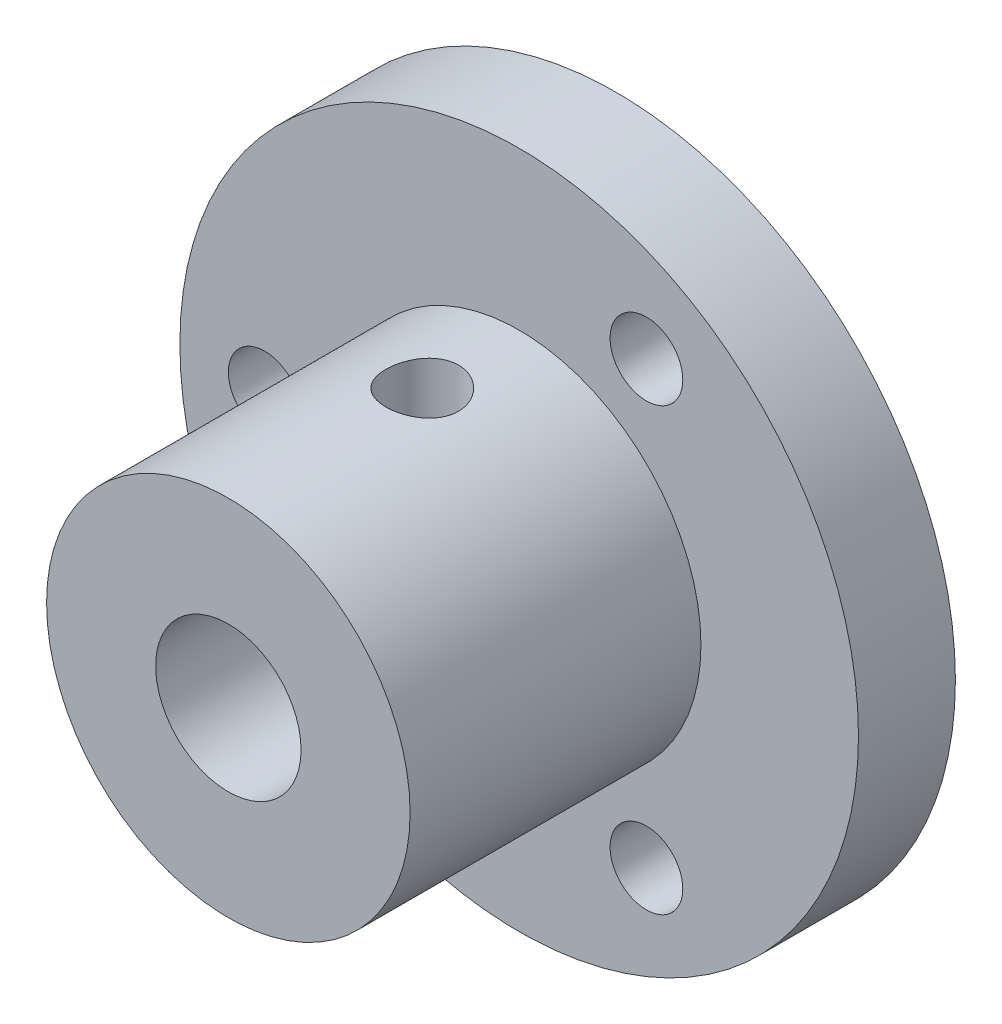
ISO-10303-21;
HEADER;
FILE_DESCRIPTION(('STEP AP214'),'2;1');
FILE_NAME('part.step','',(''),(''),'','','');
FILE_SCHEMA(('AUTOMOTIVE_DESIGN { 1 0 10303 214 1 1 1 1 }'));
ENDSEC;
DATA;
#1=APPLICATION_CONTEXT('core data for automotive mechanical design processes');
#2=APPLICATION_PROTOCOL_DEFINITION('international standard','automotive_design',2000,#1);
#3=PRODUCT_CONTEXT('',#1,'mechanical');
#4=PRODUCT('Part','Part','',(#3));
#5=PRODUCT_RELATED_PRODUCT_CATEGORY('part','',(#4));
#6=PRODUCT_DEFINITION_FORMATION('','',#4);
#7=PRODUCT_DEFINITION_CONTEXT('part definition',#1,'design');
#8=PRODUCT_DEFINITION('design','',#6,#7);
#9=PRODUCT_DEFINITION_SHAPE('','',#8);
#10=(LENGTH_UNIT() NAMED_UNIT(*) SI_UNIT(.MILLI.,.METRE.));
#11=(NAMED_UNIT(*) PLANE_ANGLE_UNIT() SI_UNIT($,.RADIAN.));
#12=(NAMED_UNIT(*) SI_UNIT($,.STERADIAN.) SOLID_ANGLE_UNIT());
#13=UNCERTAINTY_MEASURE_WITH_UNIT(LENGTH_MEASURE(1.E-05),#10,'distance_accuracy_value','');
#14=(GEOMETRIC_REPRESENTATION_CONTEXT(3) GLOBAL_UNCERTAINTY_ASSIGNED_CONTEXT((#13)) GLOBAL_UNIT_ASSIGNED_CONTEXT((#10,
#11,#12)) REPRESENTATION_CONTEXT('',''));
#15=CARTESIAN_POINT('',(0.,0.,0.));
#16=DIRECTION('',(0.,0.,1.));
#17=DIRECTION('',(1.,0.,0.));
#18=AXIS2_PLACEMENT_3D('',#15,#16,#17);
#19=CARTESIAN_POINT('',(0.,0.,4.));
#20=DIRECTION('',(0.,0.,-1.));
#21=DIRECTION('',(-1.,0.,0.));
#22=AXIS2_PLACEMENT_3D('',#19,#20,#21);
#23=CYLINDRICAL_SURFACE('',#22,3.);
#24=CARTESIAN_POINT('',(0.,-3.,6.5));
#25=CARTESIAN_POINT('',(0.0788579444268503,-2.99999570107562,6.50000495347579));
#26=CARTESIAN_POINT('',(0.157809899546344,-2.99685736529635,6.50625510968158));
#27=CARTESIAN_POINT('',(0.313380352903345,-2.98461234055736,6.53097932051231));
#28=CARTESIAN_POINT('',(0.389994130070445,-2.97549431743379,6.54947658949672));
#29=CARTESIAN_POINT('',(0.538400317320674,-2.95224419105063,6.59779071292494));
#30=CARTESIAN_POINT('',(0.61021020440872,-2.93813158766306,6.62756357637195));
#31=CARTESIAN_POINT('',(0.747708925209899,-2.90618664773642,6.69735593204748));
#32=CARTESIAN_POINT('',(0.81339824098509,-2.88835460450288,6.7373746163733));
#33=CARTESIAN_POINT('',(0.941261726642865,-2.84934387387093,6.82927587422793));
#34=CARTESIAN_POINT('',(1.00298281668316,-2.82802798691306,6.88172971885946));
#35=CARTESIAN_POINT('',(1.11716916730047,-2.78489955370114,6.99578221887056));
#36=CARTESIAN_POINT('',(1.16962737466015,-2.76308664313552,7.05738777765866));
#37=CARTESIAN_POINT('',(1.26787800067542,-2.71948426796021,7.19372502428507));
#38=CARTESIAN_POINT('',(1.31283800332746,-2.69782780455198,7.26910414751887));
#39=CARTESIAN_POINT('',(1.38925234033604,-2.65928968158481,7.42755100397932));
#40=CARTESIAN_POINT('',(1.4207163224495,-2.64240461410484,7.51061319308412));
#41=CARTESIAN_POINT('',(1.46719866328288,-2.61686800556713,7.67699765813289));
#42=CARTESIAN_POINT('',(1.48308878562066,-2.6077840737557,7.76000667810109));
#43=CARTESIAN_POINT('',(1.50064048996327,-2.59772834922792,7.92796825666922));
#44=CARTESIAN_POINT('',(1.50231613255961,-2.59674854014932,8.01291881130673));
#45=CARTESIAN_POINT('',(1.49203093075844,-2.60266395385873,8.17142903647305));
#46=CARTESIAN_POINT('',(1.48167683930523,-2.6086314549302,8.24513604683458));
#47=CARTESIAN_POINT('',(1.4504097735854,-2.62614343100775,8.38958286405956));
#48=CARTESIAN_POINT('',(1.42949343584648,-2.63768968247664,8.46032171795797));
#49=CARTESIAN_POINT('',(1.37731467057901,-2.66531214619112,8.59884369884849));
#50=CARTESIAN_POINT('',(1.34582260067399,-2.68148760995998,8.66651959817868));
#51=CARTESIAN_POINT('',(1.27356253150201,-2.71655106422105,8.79595143888501));
#52=CARTESIAN_POINT('',(1.2327903657187,-2.73544027170286,8.85770470340013));
#53=CARTESIAN_POINT('',(1.13709908236918,-2.77669736854929,8.98178187911484));
#54=CARTESIAN_POINT('',(1.08104168755392,-2.79920265355119,9.04318531036424));
#55=CARTESIAN_POINT('',(0.959333368112062,-2.84321434950611,9.15610312788635));
#56=CARTESIAN_POINT('',(0.89367788486143,-2.86472027938201,9.20761278805082));
#57=CARTESIAN_POINT('',(0.750774758747775,-2.90552980924446,9.30152849154459));
#58=CARTESIAN_POINT('',(0.673130387399115,-2.92468476243011,9.34340070866861));
#59=CARTESIAN_POINT('',(0.510699323233197,-2.95736821681863,9.41314554356451));
#60=CARTESIAN_POINT('',(0.425918364397915,-2.9709011841533,9.44102927752275));
#61=CARTESIAN_POINT('',(0.259149737491054,-2.98986500612153,9.47971310557501));
#62=CARTESIAN_POINT('',(0.17751229582249,-2.99587407451965,9.49173685362017));
#63=CARTESIAN_POINT('',(0.0131693999240281,-3.00109520188655,9.50219709670173));
#64=CARTESIAN_POINT('',(-0.0695355298048624,-3.00031048081978,9.5006400284592));
#65=CARTESIAN_POINT('',(-0.22684945797898,-2.99236788380152,9.48468996737189));
#66=CARTESIAN_POINT('',(-0.301589112074895,-2.98570868532253,9.47130120090501));
#67=CARTESIAN_POINT('',(-0.447610338452911,-2.9673325697226,9.43364289215732));
#68=CARTESIAN_POINT('',(-0.51889152853663,-2.95561509501618,9.40937215031976));
#69=CARTESIAN_POINT('',(-0.65833291267436,-2.92776377120382,9.35000230035045));
#70=CARTESIAN_POINT('',(-0.726345595508706,-2.91151322654446,9.31461342482557));
#71=CARTESIAN_POINT('',(-0.855692042548908,-2.87615961476126,9.23433869653015));
#72=CARTESIAN_POINT('',(-0.917022944664888,-2.85705533350407,9.18944879810691));
#73=CARTESIAN_POINT('',(-1.03765153393382,-2.81562332004297,9.08635936200393));
#74=CARTESIAN_POINT('',(-1.09615811672854,-2.79316327265249,9.02728569733228));
#75=CARTESIAN_POINT('',(-1.20278448167828,-2.7489358741323,8.90011227308341));
#76=CARTESIAN_POINT('',(-1.25089707856781,-2.72716901100071,8.83200632172812));
#77=CARTESIAN_POINT('',(-1.33756187171853,-2.68576788309734,8.68453451874054));
#78=CARTESIAN_POINT('',(-1.37553824370037,-2.66628794383591,8.60478310085828));
#79=CARTESIAN_POINT('',(-1.43712423890206,-2.63361108441202,8.43873489863755));
#80=CARTESIAN_POINT('',(-1.46075237380053,-2.62040607332625,8.35244671029966));
#81=CARTESIAN_POINT('',(-1.49079253120031,-2.60342251538703,8.18463466567294));
#82=CARTESIAN_POINT('',(-1.49863949460818,-2.59886075197597,8.10344861984713));
#83=CARTESIAN_POINT('',(-1.5010337315643,-2.59748031962405,7.94082939925321));
#84=CARTESIAN_POINT('',(-1.49558676993486,-2.60065829439585,7.85939634689321));
#85=CARTESIAN_POINT('',(-1.47288918838996,-2.61356793076615,7.70677474769984));
#86=CARTESIAN_POINT('',(-1.45681247151455,-2.62264641723988,7.63534929478289));
#87=CARTESIAN_POINT('',(-1.41476303733662,-2.64556524281479,7.49628782086345));
#88=CARTESIAN_POINT('',(-1.38878713673988,-2.65940711354503,7.42865302686195));
#89=CARTESIAN_POINT('',(-1.32572361795085,-2.69142795546804,7.2940627235202));
#90=CARTESIAN_POINT('',(-1.28800670672355,-2.70983583593881,7.22745814725646));
#91=CARTESIAN_POINT('',(-1.20322645745609,-2.7485299745229,7.10108819572811));
#92=CARTESIAN_POINT('',(-1.15615825686234,-2.76881720693416,7.04132640421833));
#93=CARTESIAN_POINT('',(-1.04730498999206,-2.81193484737138,6.92278702646799));
#94=CARTESIAN_POINT('',(-0.984426634495893,-2.83477474959942,6.86501134647456));
#95=CARTESIAN_POINT('',(-0.849232209349797,-2.87816628389896,6.7606055248471));
#96=CARTESIAN_POINT('',(-0.776911084957797,-2.89871667939293,6.71398139079514));
#97=CARTESIAN_POINT('',(-0.62389739517442,-2.93547014349806,6.6331454559319));
#98=CARTESIAN_POINT('',(-0.543149255665097,-2.95164144740899,6.5990237461453));
#99=CARTESIAN_POINT('',(-0.376113151707131,-2.9775201194848,6.54528774836389));
#100=CARTESIAN_POINT('',(-0.289841699383651,-2.98724585044602,6.52563222979143));
#101=CARTESIAN_POINT('',(-0.168902919736344,-2.99543192870217,6.50915388337139));
#102=CARTESIAN_POINT('',(-0.135242819162348,-2.99714048010376,6.50572603870049));
#103=CARTESIAN_POINT('',(-0.0677275977076379,-2.99942545465223,6.50114800172887));
#104=CARTESIAN_POINT('',(-0.0338724714699429,-3.00000184655071,6.49999787229469));
#105=CARTESIAN_POINT('',(0.,-3.,6.5));
#106=B_SPLINE_CURVE_WITH_KNOTS('',3,(#24,#25,#26,#27,#28,#29,#30,#31,#32,#33,#34,#35,#36,#37,
#38,#39,#40,#41,#42,#43,#44,#45,#46,#47,#48,#49,#50,#51,#52,#53,#54,#55,#56,#57,#58,#59,#60,#61,
#62,#63,#64,#65,#66,#67,#68,#69,#70,#71,#72,#73,#74,#75,#76,#77,#78,#79,#80,#81,#82,#83,#84,#85,
#86,#87,#88,#89,#90,#91,#92,#93,#94,#95,#96,#97,#98,#99,#100,#101,#102,#103,#104,#105),
.UNSPECIFIED.,.T.,.F.,(4,2,2,2,2,2,2,2,2,2,2,2,2,2,2,2,2,2,2,2,2,2,2,2,2,2,2,2,2,2,2,2,2,2,2,2,
2,2,2,2,4),(0.,0.236436386130439,0.473322224563797,0.709293233238448,0.945245640872353,
1.19547263807713,1.44588935648105,1.71572589646129,1.98536921847422,2.23887018210345,
2.49212035993531,2.71508568613981,2.93812205888518,3.16635360252731,3.39468781890332,
3.65197412000818,3.90938301898029,4.17874533321661,4.44789325368419,4.69474935707018,
4.94148846767214,5.16910359759183,5.39674382446397,5.63089284041848,5.86514176122509,
6.12239415966629,6.37982382923148,6.64972023242589,6.91926767918177,7.1629396125457,
7.40650589797018,7.62686895373284,7.84730293182527,8.08254685170431,8.31791341715446,
8.58187864135757,8.84598575071869,9.1119602049529,9.37717362931724,9.47872920200875,
9.58028757766599),.UNSPECIFIED.);
#107=CARTESIAN_POINT('',(0.,-3.,6.5));
#108=VERTEX_POINT('',#107);
#109=EDGE_CURVE('E105',#108,#108,#106,.T.);
#110=ORIENTED_EDGE('',*,*,#109,.T.);
#111=EDGE_LOOP('',(#110));
#112=FACE_BOUND('',#111,.T.);
#113=CARTESIAN_POINT('',(0.,0.,0.));
#114=DIRECTION('',(0.,0.,1.));
#115=DIRECTION('',(1.,0.,0.));
#116=AXIS2_PLACEMENT_3D('',#113,#114,#115);
#117=CIRCLE('',#116,3.);
#118=CARTESIAN_POINT('',(3.,0.,0.));
#119=VERTEX_POINT('',#118);
#120=EDGE_CURVE('E63',#119,#119,#117,.T.);
#121=ORIENTED_EDGE('',*,*,#120,.F.);
#122=EDGE_LOOP('',(#121));
#123=FACE_BOUND('',#122,.T.);
#124=CARTESIAN_POINT('',(0.,0.,16.));
#125=DIRECTION('',(0.,0.,1.));
#126=DIRECTION('',(1.,0.,0.));
#127=AXIS2_PLACEMENT_3D('',#124,#125,#126);
#128=CIRCLE('',#127,3.);
#129=CARTESIAN_POINT('',(3.,0.,16.));
#130=VERTEX_POINT('',#129);
#131=EDGE_CURVE('E155',#130,#130,#128,.T.);
#132=ORIENTED_EDGE('',*,*,#131,.T.);
#133=EDGE_LOOP('',(#132));
#134=FACE_BOUND('',#133,.T.);
#135=CARTESIAN_POINT('',(0.,3.,6.5));
#136=CARTESIAN_POINT('',(-0.0788579444268501,2.99999570107562,6.50000495347579));
#137=CARTESIAN_POINT('',(-0.157809899546344,2.99685736529635,6.50625510968158));
#138=CARTESIAN_POINT('',(-0.313380352903344,2.98461234055736,6.53097932051231));
#139=CARTESIAN_POINT('',(-0.389994130070444,2.97549431743379,6.54947658949672));
#140=CARTESIAN_POINT('',(-0.538400317320673,2.95224419105063,6.59779071292494));
#141=CARTESIAN_POINT('',(-0.610210204408719,2.93813158766306,6.62756357637195));
#142=CARTESIAN_POINT('',(-0.747708925209897,2.90618664773642,6.69735593204748));
#143=CARTESIAN_POINT('',(-0.813398240985088,2.88835460450288,6.7373746163733));
#144=CARTESIAN_POINT('',(-0.941261726642863,2.84934387387093,6.82927587422793));
#145=CARTESIAN_POINT('',(-1.00298281668316,2.82802798691306,6.88172971885946));
#146=CARTESIAN_POINT('',(-1.11716916730047,2.78489955370115,6.99578221887055));
#147=CARTESIAN_POINT('',(-1.16962737466015,2.76308664313552,7.05738777765866));
#148=CARTESIAN_POINT('',(-1.26787800067542,2.71948426796021,7.19372502428507));
#149=CARTESIAN_POINT('',(-1.31283800332745,2.69782780455198,7.26910414751887));
#150=CARTESIAN_POINT('',(-1.38925234033604,2.65928968158481,7.42755100397932));
#151=CARTESIAN_POINT('',(-1.4207163224495,2.64240461410484,7.51061319308412));
#152=CARTESIAN_POINT('',(-1.46719866328288,2.61686800556713,7.67699765813288));
#153=CARTESIAN_POINT('',(-1.48308878562066,2.6077840737557,7.76000667810109));
#154=CARTESIAN_POINT('',(-1.50064048996327,2.59772834922792,7.92796825666921));
#155=CARTESIAN_POINT('',(-1.50231613255961,2.59674854014932,8.01291881130673));
#156=CARTESIAN_POINT('',(-1.49203093075844,2.60266395385873,8.17142903647305));
#157=CARTESIAN_POINT('',(-1.48167683930523,2.6086314549302,8.24513604683457));
#158=CARTESIAN_POINT('',(-1.4504097735854,2.62614343100775,8.38958286405956));
#159=CARTESIAN_POINT('',(-1.42949343584648,2.63768968247664,8.46032171795797));
#160=CARTESIAN_POINT('',(-1.37731467057901,2.66531214619112,8.59884369884849));
#161=CARTESIAN_POINT('',(-1.34582260067399,2.68148760995998,8.66651959817868));
#162=CARTESIAN_POINT('',(-1.273562531502,2.71655106422105,8.79595143888501));
#163=CARTESIAN_POINT('',(-1.2327903657187,2.73544027170286,8.85770470340013));
#164=CARTESIAN_POINT('',(-1.13709908236918,2.77669736854929,8.98178187911484));
#165=CARTESIAN_POINT('',(-1.08104168755392,2.79920265355119,9.04318531036424));
#166=CARTESIAN_POINT('',(-0.959333368112062,2.84321434950611,9.15610312788635));
#167=CARTESIAN_POINT('',(-0.893677884861429,2.86472027938201,9.20761278805082));
#168=CARTESIAN_POINT('',(-0.750774758747774,2.90552980924446,9.30152849154459));
#169=CARTESIAN_POINT('',(-0.673130387399115,2.92468476243011,9.34340070866861));
#170=CARTESIAN_POINT('',(-0.510699323233196,2.95736821681863,9.41314554356451));
#171=CARTESIAN_POINT('',(-0.425918364397915,2.9709011841533,9.44102927752275));
#172=CARTESIAN_POINT('',(-0.259149737491053,2.98986500612153,9.47971310557501));
#173=CARTESIAN_POINT('',(-0.17751229582249,2.99587407451965,9.49173685362017));
#174=CARTESIAN_POINT('',(-0.0131693999240279,3.00109520188655,9.50219709670173));
#175=CARTESIAN_POINT('',(0.0695355298048626,3.00031048081978,9.5006400284592));
#176=CARTESIAN_POINT('',(0.22684945797898,2.99236788380152,9.48468996737189));
#177=CARTESIAN_POINT('',(0.301589112074895,2.98570868532253,9.47130120090501));
#178=CARTESIAN_POINT('',(0.447610338452911,2.9673325697226,9.43364289215732));
#179=CARTESIAN_POINT('',(0.51889152853663,2.95561509501618,9.40937215031976));
#180=CARTESIAN_POINT('',(0.658332912674358,2.92776377120382,9.35000230035045));
#181=CARTESIAN_POINT('',(0.726345595508704,2.91151322654446,9.31461342482557));
#182=CARTESIAN_POINT('',(0.855692042548906,2.87615961476126,9.23433869653015));
#183=CARTESIAN_POINT('',(0.917022944664887,2.85705533350407,9.18944879810691));
#184=CARTESIAN_POINT('',(1.03765153393382,2.81562332004297,9.08635936200393));
#185=CARTESIAN_POINT('',(1.09615811672854,2.79316327265249,9.02728569733228));
#186=CARTESIAN_POINT('',(1.20278448167828,2.7489358741323,8.90011227308341));
#187=CARTESIAN_POINT('',(1.25089707856781,2.72716901100071,8.83200632172812));
#188=CARTESIAN_POINT('',(1.33756187171853,2.68576788309734,8.68453451874054));
#189=CARTESIAN_POINT('',(1.37553824370037,2.66628794383591,8.60478310085828));
#190=CARTESIAN_POINT('',(1.43712423890206,2.63361108441202,8.43873489863756));
#191=CARTESIAN_POINT('',(1.46075237380052,2.62040607332625,8.35244671029967));
#192=CARTESIAN_POINT('',(1.49079253120031,2.60342251538703,8.18463466567295));
#193=CARTESIAN_POINT('',(1.49863949460818,2.59886075197597,8.10344861984714));
#194=CARTESIAN_POINT('',(1.5010337315643,2.59748031962405,7.94082939925321));
#195=CARTESIAN_POINT('',(1.49558676993486,2.60065829439585,7.85939634689321));
#196=CARTESIAN_POINT('',(1.47288918838997,2.61356793076615,7.70677474769985));
#197=CARTESIAN_POINT('',(1.45681247151455,2.62264641723988,7.63534929478289));
#198=CARTESIAN_POINT('',(1.41476303733662,2.64556524281479,7.49628782086345));
#199=CARTESIAN_POINT('',(1.38878713673988,2.65940711354503,7.42865302686195));
#200=CARTESIAN_POINT('',(1.32572361795085,2.69142795546804,7.2940627235202));
#201=CARTESIAN_POINT('',(1.28800670672355,2.70983583593881,7.22745814725646));
#202=CARTESIAN_POINT('',(1.20322645745609,2.74852997452291,7.10108819572811));
#203=CARTESIAN_POINT('',(1.15615825686234,2.76881720693416,7.04132640421833));
#204=CARTESIAN_POINT('',(1.04730498999206,2.81193484737138,6.92278702646799));
#205=CARTESIAN_POINT('',(0.984426634495893,2.83477474959942,6.86501134647456));
#206=CARTESIAN_POINT('',(0.849232209349796,2.87816628389896,6.7606055248471));
#207=CARTESIAN_POINT('',(0.776911084957796,2.89871667939293,6.71398139079514));
#208=CARTESIAN_POINT('',(0.623897395174418,2.93547014349806,6.63314545593189));
#209=CARTESIAN_POINT('',(0.543149255665095,2.95164144740899,6.5990237461453));
#210=CARTESIAN_POINT('',(0.37611315170713,2.9775201194848,6.54528774836389));
#211=CARTESIAN_POINT('',(0.28984169938365,2.98724585044602,6.52563222979143));
#212=CARTESIAN_POINT('',(0.168902919736343,2.99543192870217,6.50915388337139));
#213=CARTESIAN_POINT('',(0.135242819162347,2.99714048010376,6.50572603870049));
#214=CARTESIAN_POINT('',(0.0677275977076369,2.99942545465223,6.50114800172887));
#215=CARTESIAN_POINT('',(0.0338724714699424,3.00000184655071,6.49999787229469));
#216=CARTESIAN_POINT('',(0.,3.,6.5));
#217=B_SPLINE_CURVE_WITH_KNOTS('',3,(#135,#136,#137,#138,#139,#140,#141,#142,#143,#144,#145,
#146,#147,#148,#149,#150,#151,#152,#153,#154,#155,#156,#157,#158,#159,#160,#161,#162,#163,#164,
#165,#166,#167,#168,#169,#170,#171,#172,#173,#174,#175,#176,#177,#178,#179,#180,#181,#182,#183,
#184,#185,#186,#187,#188,#189,#190,#191,#192,#193,#194,#195,#196,#197,#198,#199,#200,#201,#202,
#203,#204,#205,#206,#207,#208,#209,#210,#211,#212,#213,#214,#215,#216),.UNSPECIFIED.,.T.,.F.,(4,
2,2,2,2,2,2,2,2,2,2,2,2,2,2,2,2,2,2,2,2,2,2,2,2,2,2,2,2,2,2,2,2,2,2,2,2,2,2,2,4),(0.,
0.236436386130438,0.473322224563796,0.709293233238446,0.94524564087235,1.19547263807713,
1.44588935648105,1.71572589646129,1.98536921847421,2.23887018210344,2.4921203599353,
2.71508568613981,2.93812205888517,3.16635360252731,3.39468781890333,3.65197412000818,
3.90938301898029,4.17874533321661,4.4478932536842,4.69474935707019,4.94148846767214,
5.16910359759183,5.39674382446397,5.63089284041848,5.86514176122509,6.12239415966628,
6.37982382923148,6.64972023242588,6.91926767918176,7.1629396125457,7.40650589797018,
7.62686895373284,7.84730293182527,8.08254685170431,8.31791341715446,8.58187864135757,
8.84598575071869,9.1119602049529,9.37717362931724,9.47872920200876,9.58028757766599),.UNSPECIFIED.);
#218=CARTESIAN_POINT('',(0.,3.,6.5));
#219=VERTEX_POINT('',#218);
#220=EDGE_CURVE('E110',#219,#219,#217,.T.);
#221=ORIENTED_EDGE('',*,*,#220,.T.);
#222=EDGE_LOOP('',(#221));
#223=FACE_BOUND('',#222,.T.);
#224=ADVANCED_FACE('F39',(#112,#123,#134,#223),#23,.F.);
#225=CARTESIAN_POINT('',(0.,0.,16.));
#226=DIRECTION('',(0.,0.,-1.));
#227=DIRECTION('',(-1.,0.,0.));
#228=AXIS2_PLACEMENT_3D('',#225,#226,#227);
#229=CYLINDRICAL_SURFACE('',#228,7.5);
#230=CARTESIAN_POINT('',(0.,0.,16.));
#231=DIRECTION('',(0.,0.,1.));
#232=DIRECTION('',(1.,0.,0.));
#233=AXIS2_PLACEMENT_3D('',#230,#231,#232);
#234=CIRCLE('',#233,7.5);
#235=CARTESIAN_POINT('',(7.5,0.,16.));
#236=VERTEX_POINT('',#235);
#237=EDGE_CURVE('E61',#236,#236,#234,.T.);
#238=ORIENTED_EDGE('',*,*,#237,.F.);
#239=EDGE_LOOP('',(#238));
#240=FACE_BOUND('',#239,.T.);
#241=CARTESIAN_POINT('',(0.,0.,4.));
#242=DIRECTION('',(0.,0.,1.));
#243=DIRECTION('',(1.,0.,0.));
#244=AXIS2_PLACEMENT_3D('',#241,#242,#243);
#245=CIRCLE('',#244,7.5);
#246=CARTESIAN_POINT('',(7.5,0.,4.));
#247=VERTEX_POINT('',#246);
#248=EDGE_CURVE('E10',#247,#247,#245,.T.);
#249=ORIENTED_EDGE('',*,*,#248,.T.);
#250=EDGE_LOOP('',(#249));
#251=FACE_BOUND('',#250,.T.);
#252=CARTESIAN_POINT('',(0.,-7.5,6.5));
#253=CARTESIAN_POINT('',(0.0833653601889499,-7.49999846371307,6.50000306674752));
#254=CARTESIAN_POINT('',(0.166769490302284,-7.49859577767346,6.50697326445147));
#255=CARTESIAN_POINT('',(0.331220261533529,-7.49313548434847,6.53464775017287));
#256=CARTESIAN_POINT('',(0.412264976312034,-7.48907576790279,6.55536294920226));
#257=CARTESIAN_POINT('',(0.56959545789497,-7.4787547391743,6.60986191043118));
#258=CARTESIAN_POINT('',(0.645885701899702,-7.47249553615077,6.64363315526703));
#259=CARTESIAN_POINT('',(0.791711983296339,-7.45845597052971,6.72324837126694));
#260=CARTESIAN_POINT('',(0.861248422613719,-7.4506756985356,6.76909162341081));
#261=CARTESIAN_POINT('',(0.992540215972298,-7.43433247994955,6.87220774143715));
#262=CARTESIAN_POINT('',(1.05419092673779,-7.42576118256521,6.9296125330868));
#263=CARTESIAN_POINT('',(1.16705513491204,-7.40886270678882,7.05393862458755));
#264=CARTESIAN_POINT('',(1.21826781715564,-7.40053554750636,7.12086066700268));
#265=CARTESIAN_POINT('',(1.30924763002143,-7.38498662718923,7.26307428951781));
#266=CARTESIAN_POINT('',(1.3489064082988,-7.37777561047419,7.33843646569454));
#267=CARTESIAN_POINT('',(1.41495849987046,-7.36539402087627,7.49492272850612));
#268=CARTESIAN_POINT('',(1.44135312365586,-7.36022324642942,7.57604624501952));
#269=CARTESIAN_POINT('',(1.47978794982724,-7.35259207878307,7.74062654586188));
#270=CARTESIAN_POINT('',(1.49201174693817,-7.35009705160781,7.82403881621334));
#271=CARTESIAN_POINT('',(1.50232819158918,-7.34799562590941,7.99176473204652));
#272=CARTESIAN_POINT('',(1.50042228407025,-7.34838893201761,8.07607828448022));
#273=CARTESIAN_POINT('',(1.48268185965273,-7.35198826722277,8.24187018203151));
#274=CARTESIAN_POINT('',(1.46705781036586,-7.35515179288145,8.32337210844097));
#275=CARTESIAN_POINT('',(1.42265682693458,-7.36386819240002,8.4825741149945));
#276=CARTESIAN_POINT('',(1.39387926465102,-7.36942118036668,8.56027401337851));
#277=CARTESIAN_POINT('',(1.32378717551208,-7.38233427750612,8.7102728925554));
#278=CARTESIAN_POINT('',(1.28238922684817,-7.38970634720557,8.78253181935376));
#279=CARTESIAN_POINT('',(1.18829036185902,-7.40541928159593,8.91915627495922));
#280=CARTESIAN_POINT('',(1.13558814653524,-7.41376025757549,8.98352089527674));
#281=CARTESIAN_POINT('',(1.01924990184088,-7.43065531862193,9.1037441036854));
#282=CARTESIAN_POINT('',(0.955434241818668,-7.43921053816357,9.1594288517887));
#283=CARTESIAN_POINT('',(0.819277536093015,-7.45543273071613,9.25933076945184));
#284=CARTESIAN_POINT('',(0.746936381069084,-7.4630996923346,9.30354779194037));
#285=CARTESIAN_POINT('',(0.595589080318382,-7.47670035241331,9.37929126383896));
#286=CARTESIAN_POINT('',(0.516572729377951,-7.48263133272408,9.41079784046681));
#287=CARTESIAN_POINT('',(0.354223464672998,-7.49207113481787,9.46004071105785));
#288=CARTESIAN_POINT('',(0.270891075108675,-7.49558025000797,9.47777867311044));
#289=CARTESIAN_POINT('',(0.103769108440726,-7.49974007800302,9.49873468069142));
#290=CARTESIAN_POINT('',(0.0200104924883649,-7.50043761978705,9.5021906293104));
#291=CARTESIAN_POINT('',(-0.146887401289071,-7.49902577895154,9.49512521158673));
#292=CARTESIAN_POINT('',(-0.23002671366569,-7.49691655412169,9.48460463097111));
#293=CARTESIAN_POINT('',(-0.392558489919811,-7.49015748012026,9.45008243968407));
#294=CARTESIAN_POINT('',(-0.471977922509854,-7.4855306460631,9.42620289725315));
#295=CARTESIAN_POINT('',(-0.625685441249501,-7.47425328091549,9.36577402601629));
#296=CARTESIAN_POINT('',(-0.69997314245631,-7.4676025982134,9.32922374798476));
#297=CARTESIAN_POINT('',(-0.842311760529327,-7.45289867299942,9.24397626402303));
#298=CARTESIAN_POINT('',(-0.910275190128282,-7.44482925655578,9.19513582844158));
#299=CARTESIAN_POINT('',(-1.03712702867881,-7.42822102244824,9.08688621318908));
#300=CARTESIAN_POINT('',(-1.09601446339614,-7.41968215452582,9.0274759004002));
#301=CARTESIAN_POINT('',(-1.20396088616126,-7.40293955335447,8.89868997216331));
#302=CARTESIAN_POINT('',(-1.25285655367298,-7.39474290349956,8.82917638366799));
#303=CARTESIAN_POINT('',(-1.33827813007681,-7.37976287694291,8.68278295796498));
#304=CARTESIAN_POINT('',(-1.37480453388435,-7.37297944370014,8.60590341563967));
#305=CARTESIAN_POINT('',(-1.43422776237294,-7.36165110876574,8.44734763077568));
#306=CARTESIAN_POINT('',(-1.45719524968658,-7.3570946230828,8.36569873818452));
#307=CARTESIAN_POINT('',(-1.48906297744079,-7.35071155188038,8.19959981976364));
#308=CARTESIAN_POINT('',(-1.49796505233767,-7.34888461036667,8.11515016068598));
#309=CARTESIAN_POINT('',(-1.5013813663012,-7.34818724447069,7.94748670318352));
#310=CARTESIAN_POINT('',(-1.49615368210634,-7.34926378783951,7.86427827660949));
#311=CARTESIAN_POINT('',(-1.47202845615009,-7.35413360226921,7.69995252514246));
#312=CARTESIAN_POINT('',(-1.45313102419395,-7.35792685150754,7.61883518345779));
#313=CARTESIAN_POINT('',(-1.40231785274843,-7.36777896328738,7.46115843313918));
#314=CARTESIAN_POINT('',(-1.37043376007602,-7.37383231528246,7.38458845924638));
#315=CARTESIAN_POINT('',(-1.29458196690241,-7.38752572461255,7.23784441889834));
#316=CARTESIAN_POINT('',(-1.25061325316232,-7.39516591498341,7.16767088941229));
#317=CARTESIAN_POINT('',(-1.15095887217962,-7.41133440784838,7.03442664177453));
#318=CARTESIAN_POINT('',(-1.09508683085277,-7.41987559364549,6.97149685209861));
#319=CARTESIAN_POINT('',(-0.973596553519712,-7.43679122807932,6.85582069170624));
#320=CARTESIAN_POINT('',(-0.907976080730004,-7.44516563794777,6.80307666452409));
#321=CARTESIAN_POINT('',(-0.768026443632371,-7.46090748581957,6.70874803408033));
#322=CARTESIAN_POINT('',(-0.693613326644754,-7.46826346828869,6.66728599507996));
#323=CARTESIAN_POINT('',(-0.538749541411101,-7.481026876275,6.59752081610511));
#324=CARTESIAN_POINT('',(-0.458304391294691,-7.48643605707924,6.56920581570126));
#325=CARTESIAN_POINT('',(-0.314732233385671,-7.49364558893056,6.53202207793293));
#326=CARTESIAN_POINT('',(-0.252422496020679,-7.49601454737678,6.52003520943836));
#327=CARTESIAN_POINT('',(-0.126749287815102,-7.49919231209839,6.50402313146245));
#328=CARTESIAN_POINT('',(-0.0633858506229291,-7.50000116809732,6.49999766823535));
#329=CARTESIAN_POINT('',(0.,-7.5,6.5));
#330=B_SPLINE_CURVE_WITH_KNOTS('',3,(#252,#253,#254,#255,#256,#257,#258,#259,#260,#261,#262,
#263,#264,#265,#266,#267,#268,#269,#270,#271,#272,#273,#274,#275,#276,#277,#278,#279,#280,#281,
#282,#283,#284,#285,#286,#287,#288,#289,#290,#291,#292,#293,#294,#295,#296,#297,#298,#299,#300,
#301,#302,#303,#304,#305,#306,#307,#308,#309,#310,#311,#312,#313,#314,#315,#316,#317,#318,#319,
#320,#321,#322,#323,#324,#325,#326,#327,#328,#329),.UNSPECIFIED.,.T.,.F.,(4,2,2,2,2,2,2,2,2,2,2,
2,2,2,2,2,2,2,2,2,2,2,2,2,2,2,2,2,2,2,2,2,2,2,2,2,2,2,4),(0.,0.249864195991888,
0.499926976036985,0.749750602875513,0.999559353346296,1.25239900516828,1.50525839512105,
1.76041792508884,2.01555224047796,2.26734277655381,2.51910756421838,2.76707590509418,
3.01505608880595,3.26471235305389,3.51439732124506,3.76857378737026,4.0227535130973,
4.27732912281036,4.53187388547054,4.78216103514398,5.03243411486801,5.28045680926085,
5.52849808824034,5.77957599050038,6.03068082518895,6.28560942868839,6.540527830852,
6.79410571549085,7.04765052495622,7.29659583851552,7.54553915238913,7.79387941879665,
8.042240513728,8.29482114358715,8.54745981799396,8.80274245013456,9.05779433276278,
9.24778162934841,9.43776287056495),.UNSPECIFIED.);
#331=CARTESIAN_POINT('',(0.,-7.5,6.5));
#332=VERTEX_POINT('',#331);
#333=EDGE_CURVE('E85',#332,#332,#330,.T.);
#334=ORIENTED_EDGE('',*,*,#333,.F.);
#335=EDGE_LOOP('',(#334));
#336=FACE_BOUND('',#335,.T.);
#337=CARTESIAN_POINT('',(0.,7.5,6.5));
#338=CARTESIAN_POINT('',(-0.0833653601889499,7.49999846371307,6.50000306674752));
#339=CARTESIAN_POINT('',(-0.166769490302284,7.49859577767346,6.50697326445147));
#340=CARTESIAN_POINT('',(-0.331220261533529,7.49313548434847,6.53464775017287));
#341=CARTESIAN_POINT('',(-0.412264976312034,7.48907576790279,6.55536294920226));
#342=CARTESIAN_POINT('',(-0.569595457894969,7.4787547391743,6.60986191043118));
#343=CARTESIAN_POINT('',(-0.645885701899702,7.47249553615077,6.64363315526703));
#344=CARTESIAN_POINT('',(-0.791711983296339,7.45845597052971,6.72324837126694));
#345=CARTESIAN_POINT('',(-0.861248422613718,7.4506756985356,6.76909162341081));
#346=CARTESIAN_POINT('',(-0.992540215972297,7.43433247994955,6.87220774143715));
#347=CARTESIAN_POINT('',(-1.05419092673779,7.42576118256521,6.9296125330868));
#348=CARTESIAN_POINT('',(-1.16705513491204,7.40886270678882,7.05393862458755));
#349=CARTESIAN_POINT('',(-1.21826781715564,7.40053554750636,7.12086066700268));
#350=CARTESIAN_POINT('',(-1.30924763002143,7.38498662718923,7.26307428951781));
#351=CARTESIAN_POINT('',(-1.3489064082988,7.37777561047419,7.33843646569454));
#352=CARTESIAN_POINT('',(-1.41495849987046,7.36539402087627,7.49492272850612));
#353=CARTESIAN_POINT('',(-1.44135312365586,7.36022324642942,7.57604624501952));
#354=CARTESIAN_POINT('',(-1.47978794982724,7.35259207878307,7.74062654586187));
#355=CARTESIAN_POINT('',(-1.49201174693817,7.35009705160781,7.82403881621334));
#356=CARTESIAN_POINT('',(-1.50232819158918,7.34799562590941,7.99176473204651));
#357=CARTESIAN_POINT('',(-1.50042228407025,7.34838893201761,8.07607828448022));
#358=CARTESIAN_POINT('',(-1.48268185965273,7.35198826722277,8.24187018203151));
#359=CARTESIAN_POINT('',(-1.46705781036586,7.35515179288145,8.32337210844097));
#360=CARTESIAN_POINT('',(-1.42265682693458,7.36386819240002,8.4825741149945));
#361=CARTESIAN_POINT('',(-1.39387926465102,7.36942118036668,8.56027401337851));
#362=CARTESIAN_POINT('',(-1.32378717551208,7.38233427750612,8.7102728925554));
#363=CARTESIAN_POINT('',(-1.28238922684817,7.38970634720557,8.78253181935376));
#364=CARTESIAN_POINT('',(-1.18829036185902,7.40541928159593,8.91915627495922));
#365=CARTESIAN_POINT('',(-1.13558814653524,7.41376025757549,8.98352089527674));
#366=CARTESIAN_POINT('',(-1.01924990184088,7.43065531862193,9.1037441036854));
#367=CARTESIAN_POINT('',(-0.955434241818668,7.43921053816357,9.1594288517887));
#368=CARTESIAN_POINT('',(-0.819277536093015,7.45543273071613,9.25933076945184));
#369=CARTESIAN_POINT('',(-0.746936381069084,7.4630996923346,9.30354779194037));
#370=CARTESIAN_POINT('',(-0.595589080318382,7.47670035241331,9.37929126383896));
#371=CARTESIAN_POINT('',(-0.516572729377951,7.48263133272408,9.41079784046681));
#372=CARTESIAN_POINT('',(-0.354223464672998,7.49207113481787,9.46004071105785));
#373=CARTESIAN_POINT('',(-0.270891075108675,7.49558025000797,9.47777867311044));
#374=CARTESIAN_POINT('',(-0.103769108440726,7.49974007800302,9.49873468069142));
#375=CARTESIAN_POINT('',(-0.0200104924883651,7.50043761978705,9.5021906293104));
#376=CARTESIAN_POINT('',(0.14688740128907,7.49902577895154,9.49512521158673));
#377=CARTESIAN_POINT('',(0.230026713665689,7.49691655412169,9.48460463097111));
#378=CARTESIAN_POINT('',(0.392558489919811,7.49015748012026,9.45008243968407));
#379=CARTESIAN_POINT('',(0.471977922509854,7.4855306460631,9.42620289725315));
#380=CARTESIAN_POINT('',(0.6256854412495,7.47425328091549,9.36577402601629));
#381=CARTESIAN_POINT('',(0.699973142456309,7.4676025982134,9.32922374798476));
#382=CARTESIAN_POINT('',(0.842311760529326,7.45289867299942,9.24397626402303));
#383=CARTESIAN_POINT('',(0.910275190128282,7.44482925655578,9.19513582844158));
#384=CARTESIAN_POINT('',(1.03712702867881,7.42822102244824,9.08688621318908));
#385=CARTESIAN_POINT('',(1.09601446339614,7.41968215452582,9.0274759004002));
#386=CARTESIAN_POINT('',(1.20396088616126,7.40293955335447,8.89868997216331));
#387=CARTESIAN_POINT('',(1.25285655367298,7.39474290349956,8.829176383668));
#388=CARTESIAN_POINT('',(1.33827813007681,7.37976287694291,8.68278295796498));
#389=CARTESIAN_POINT('',(1.37480453388435,7.37297944370014,8.60590341563967));
#390=CARTESIAN_POINT('',(1.43422776237294,7.36165110876574,8.44734763077568));
#391=CARTESIAN_POINT('',(1.45719524968658,7.3570946230828,8.36569873818452));
#392=CARTESIAN_POINT('',(1.48906297744079,7.35071155188038,8.19959981976364));
#393=CARTESIAN_POINT('',(1.49796505233767,7.34888461036667,8.11515016068598));
#394=CARTESIAN_POINT('',(1.5013813663012,7.34818724447069,7.94748670318352));
#395=CARTESIAN_POINT('',(1.49615368210634,7.34926378783951,7.86427827660949));
#396=CARTESIAN_POINT('',(1.47202845615009,7.35413360226921,7.69995252514246));
#397=CARTESIAN_POINT('',(1.45313102419395,7.35792685150754,7.61883518345779));
#398=CARTESIAN_POINT('',(1.40231785274843,7.36777896328738,7.46115843313918));
#399=CARTESIAN_POINT('',(1.37043376007602,7.37383231528246,7.38458845924638));
#400=CARTESIAN_POINT('',(1.29458196690241,7.38752572461255,7.23784441889834));
#401=CARTESIAN_POINT('',(1.25061325316232,7.39516591498341,7.16767088941229));
#402=CARTESIAN_POINT('',(1.15095887217962,7.41133440784838,7.03442664177453));
#403=CARTESIAN_POINT('',(1.09508683085277,7.41987559364549,6.97149685209861));
#404=CARTESIAN_POINT('',(0.973596553519713,7.43679122807932,6.85582069170624));
#405=CARTESIAN_POINT('',(0.907976080730003,7.44516563794777,6.80307666452409));
#406=CARTESIAN_POINT('',(0.76802644363237,7.46090748581957,6.70874803408033));
#407=CARTESIAN_POINT('',(0.693613326644752,7.46826346828869,6.66728599507996));
#408=CARTESIAN_POINT('',(0.538749541411099,7.481026876275,6.59752081610511));
#409=CARTESIAN_POINT('',(0.45830439129469,7.48643605707924,6.56920581570126));
#410=CARTESIAN_POINT('',(0.31473223338567,7.49364558893056,6.53202207793293));
#411=CARTESIAN_POINT('',(0.252422496020678,7.49601454737678,6.52003520943836));
#412=CARTESIAN_POINT('',(0.126749287815101,7.49919231209839,6.50402313146245));
#413=CARTESIAN_POINT('',(0.0633858506229289,7.50000116809732,6.49999766823535));
#414=CARTESIAN_POINT('',(0.,7.5,6.5));
#415=B_SPLINE_CURVE_WITH_KNOTS('',3,(#337,#338,#339,#340,#341,#342,#343,#344,#345,#346,#347,
#348,#349,#350,#351,#352,#353,#354,#355,#356,#357,#358,#359,#360,#361,#362,#363,#364,#365,#366,
#367,#368,#369,#370,#371,#372,#373,#374,#375,#376,#377,#378,#379,#380,#381,#382,#383,#384,#385,
#386,#387,#388,#389,#390,#391,#392,#393,#394,#395,#396,#397,#398,#399,#400,#401,#402,#403,#404,
#405,#406,#407,#408,#409,#410,#411,#412,#413,#414),.UNSPECIFIED.,.T.,.F.,(4,2,2,2,2,2,2,2,2,2,2,
2,2,2,2,2,2,2,2,2,2,2,2,2,2,2,2,2,2,2,2,2,2,2,2,2,2,2,4),(0.,0.249864195991888,
0.499926976036985,0.749750602875513,0.999559353346295,1.25239900516828,1.50525839512105,
1.76041792508884,2.01555224047796,2.26734277655381,2.51910756421838,2.76707590509417,
3.01505608880595,3.26471235305389,3.51439732124506,3.76857378737026,4.0227535130973,
4.27732912281036,4.53187388547054,4.78216103514398,5.03243411486801,5.28045680926085,
5.52849808824034,5.77957599050038,6.03068082518895,6.28560942868839,6.540527830852,
6.79410571549085,7.04765052495622,7.29659583851552,7.54553915238913,7.79387941879665,
8.042240513728,8.29482114358715,8.54745981799396,8.80274245013456,9.05779433276278,
9.24778162934841,9.43776287056495),.UNSPECIFIED.);
#416=CARTESIAN_POINT('',(0.,7.5,6.5));
#417=VERTEX_POINT('',#416);
#418=EDGE_CURVE('E43',#417,#417,#415,.T.);
#419=ORIENTED_EDGE('',*,*,#418,.F.);
#420=EDGE_LOOP('',(#419));
#421=FACE_BOUND('',#420,.T.);
#422=ADVANCED_FACE('F90',(#240,#251,#336,#421),#229,.T.);
#423=CARTESIAN_POINT('',(0.,0.,4.));
#424=DIRECTION('',(0.,0.,1.));
#425=DIRECTION('',(1.,0.,0.));
#426=AXIS2_PLACEMENT_3D('',#423,#424,#425);
#427=PLANE('',#426);
#428=ORIENTED_EDGE('',*,*,#248,.F.);
#429=EDGE_LOOP('',(#428));
#430=FACE_BOUND('',#429,.T.);
#431=CARTESIAN_POINT('',(5.25,9.09326673973661,4.));
#432=DIRECTION('',(0.,0.,1.));
#433=DIRECTION('',(1.,0.,0.));
#434=AXIS2_PLACEMENT_3D('',#431,#432,#433);
#435=CIRCLE('',#434,1.5);
#436=CARTESIAN_POINT('',(6.75,9.09326673973661,4.));
#437=VERTEX_POINT('',#436);
#438=EDGE_CURVE('E67',#437,#437,#435,.T.);
#439=ORIENTED_EDGE('',*,*,#438,.F.);
#440=EDGE_LOOP('',(#439));
#441=FACE_BOUND('',#440,.T.);
#442=CARTESIAN_POINT('',(-10.5,0.,4.));
#443=DIRECTION('',(0.,0.,1.));
#444=DIRECTION('',(1.,0.,0.));
#445=AXIS2_PLACEMENT_3D('',#442,#443,#444);
#446=CIRCLE('',#445,1.5);
#447=CARTESIAN_POINT('',(-9.,0.,4.));
#448=VERTEX_POINT('',#447);
#449=EDGE_CURVE('E79',#448,#448,#446,.T.);
#450=ORIENTED_EDGE('',*,*,#449,.F.);
#451=EDGE_LOOP('',(#450));
#452=FACE_BOUND('',#451,.T.);
#453=CARTESIAN_POINT('',(0.,0.,4.));
#454=DIRECTION('',(0.,0.,1.));
#455=DIRECTION('',(1.,0.,0.));
#456=AXIS2_PLACEMENT_3D('',#453,#454,#455);
#457=CIRCLE('',#456,14.);
#458=CARTESIAN_POINT('',(14.,0.,4.));
#459=VERTEX_POINT('',#458);
#460=EDGE_CURVE('E52',#459,#459,#457,.T.);
#461=ORIENTED_EDGE('',*,*,#460,.T.);
#462=EDGE_LOOP('',(#461));
#463=FACE_BOUND('',#462,.T.);
#464=CARTESIAN_POINT('',(5.25,-9.09326673973661,4.));
#465=DIRECTION('',(0.,0.,1.));
#466=DIRECTION('',(1.,0.,0.));
#467=AXIS2_PLACEMENT_3D('',#464,#465,#466);
#468=CIRCLE('',#467,1.5);
#469=CARTESIAN_POINT('',(6.75,-9.09326673973661,4.));
#470=VERTEX_POINT('',#469);
#471=EDGE_CURVE('E73',#470,#470,#468,.T.);
#472=ORIENTED_EDGE('',*,*,#471,.F.);
#473=EDGE_LOOP('',(#472));
#474=FACE_BOUND('',#473,.T.);
#475=ADVANCED_FACE('F131',(#430,#441,#452,#463,#474),#427,.T.);
#476=CARTESIAN_POINT('',(0.,0.,0.));
#477=DIRECTION('',(0.,0.,1.));
#478=DIRECTION('',(1.,0.,0.));
#479=AXIS2_PLACEMENT_3D('',#476,#477,#478);
#480=PLANE('',#479);
#481=CARTESIAN_POINT('',(0.,0.,0.));
#482=DIRECTION('',(0.,0.,1.));
#483=DIRECTION('',(1.,0.,0.));
#484=AXIS2_PLACEMENT_3D('',#481,#482,#483);
#485=CIRCLE('',#484,14.);
#486=CARTESIAN_POINT('',(14.,0.,0.));
#487=VERTEX_POINT('',#486);
#488=EDGE_CURVE('E57',#487,#487,#485,.T.);
#489=ORIENTED_EDGE('',*,*,#488,.F.);
#490=EDGE_LOOP('',(#489));
#491=FACE_BOUND('',#490,.T.);
#492=CARTESIAN_POINT('',(-10.5,0.,0.));
#493=DIRECTION('',(0.,0.,1.));
#494=DIRECTION('',(1.,0.,0.));
#495=AXIS2_PLACEMENT_3D('',#492,#493,#494);
#496=CIRCLE('',#495,1.5);
#497=CARTESIAN_POINT('',(-9.,0.,0.));
#498=VERTEX_POINT('',#497);
#499=EDGE_CURVE('E76',#498,#498,#496,.T.);
#500=ORIENTED_EDGE('',*,*,#499,.T.);
#501=EDGE_LOOP('',(#500));
#502=FACE_BOUND('',#501,.T.);
#503=CARTESIAN_POINT('',(5.25,-9.09326673973661,0.));
#504=DIRECTION('',(0.,0.,1.));
#505=DIRECTION('',(1.,0.,0.));
#506=AXIS2_PLACEMENT_3D('',#503,#504,#505);
#507=CIRCLE('',#506,1.5);
#508=CARTESIAN_POINT('',(6.75,-9.09326673973661,0.));
#509=VERTEX_POINT('',#508);
#510=EDGE_CURVE('E70',#509,#509,#507,.T.);
#511=ORIENTED_EDGE('',*,*,#510,.T.);
#512=EDGE_LOOP('',(#511));
#513=FACE_BOUND('',#512,.T.);
#514=CARTESIAN_POINT('',(5.25,9.09326673973661,0.));
#515=DIRECTION('',(0.,0.,1.));
#516=DIRECTION('',(1.,0.,0.));
#517=AXIS2_PLACEMENT_3D('',#514,#515,#516);
#518=CIRCLE('',#517,1.5);
#519=CARTESIAN_POINT('',(6.75,9.09326673973661,0.));
#520=VERTEX_POINT('',#519);
#521=EDGE_CURVE('E66',#520,#520,#518,.T.);
#522=ORIENTED_EDGE('',*,*,#521,.T.);
#523=EDGE_LOOP('',(#522));
#524=FACE_BOUND('',#523,.T.);
#525=ORIENTED_EDGE('',*,*,#120,.T.);
#526=EDGE_LOOP('',(#525));
#527=FACE_BOUND('',#526,.T.);
#528=ADVANCED_FACE('F133',(#491,#502,#513,#524,#527),#480,.F.);
#529=CARTESIAN_POINT('',(0.,0.,4.));
#530=DIRECTION('',(0.,0.,-1.));
#531=DIRECTION('',(-1.,0.,0.));
#532=AXIS2_PLACEMENT_3D('',#529,#530,#531);
#533=CYLINDRICAL_SURFACE('',#532,14.);
#534=ORIENTED_EDGE('',*,*,#460,.F.);
#535=EDGE_LOOP('',(#534));
#536=FACE_BOUND('',#535,.T.);
#537=ORIENTED_EDGE('',*,*,#488,.T.);
#538=EDGE_LOOP('',(#537));
#539=FACE_BOUND('',#538,.T.);
#540=ADVANCED_FACE('F41',(#536,#539),#533,.T.);
#541=CARTESIAN_POINT('',(-10.5,0.,4.));
#542=DIRECTION('',(0.,0.,-1.));
#543=DIRECTION('',(-1.,0.,0.));
#544=AXIS2_PLACEMENT_3D('',#541,#542,#543);
#545=CYLINDRICAL_SURFACE('',#544,1.5);
#546=ORIENTED_EDGE('',*,*,#449,.T.);
#547=EDGE_LOOP('',(#546));
#548=FACE_BOUND('',#547,.T.);
#549=ORIENTED_EDGE('',*,*,#499,.F.);
#550=EDGE_LOOP('',(#549));
#551=FACE_BOUND('',#550,.T.);
#552=ADVANCED_FACE('F126',(#548,#551),#545,.F.);
#553=CARTESIAN_POINT('',(5.25,-9.09326673973661,4.));
#554=DIRECTION('',(0.,0.,-1.));
#555=DIRECTION('',(-1.,0.,0.));
#556=AXIS2_PLACEMENT_3D('',#553,#554,#555);
#557=CYLINDRICAL_SURFACE('',#556,1.5);
#558=ORIENTED_EDGE('',*,*,#471,.T.);
#559=EDGE_LOOP('',(#558));
#560=FACE_BOUND('',#559,.T.);
#561=ORIENTED_EDGE('',*,*,#510,.F.);
#562=EDGE_LOOP('',(#561));
#563=FACE_BOUND('',#562,.T.);
#564=ADVANCED_FACE('F122',(#560,#563),#557,.F.);
#565=CARTESIAN_POINT('',(5.25,9.09326673973661,4.));
#566=DIRECTION('',(0.,0.,-1.));
#567=DIRECTION('',(-1.,0.,0.));
#568=AXIS2_PLACEMENT_3D('',#565,#566,#567);
#569=CYLINDRICAL_SURFACE('',#568,1.5);
#570=ORIENTED_EDGE('',*,*,#438,.T.);
#571=EDGE_LOOP('',(#570));
#572=FACE_BOUND('',#571,.T.);
#573=ORIENTED_EDGE('',*,*,#521,.F.);
#574=EDGE_LOOP('',(#573));
#575=FACE_BOUND('',#574,.T.);
#576=ADVANCED_FACE('F118',(#572,#575),#569,.F.);
#577=CARTESIAN_POINT('',(0.,0.,16.));
#578=DIRECTION('',(0.,0.,1.));
#579=DIRECTION('',(1.,0.,0.));
#580=AXIS2_PLACEMENT_3D('',#577,#578,#579);
#581=PLANE('',#580);
#582=ORIENTED_EDGE('',*,*,#237,.T.);
#583=EDGE_LOOP('',(#582));
#584=FACE_BOUND('',#583,.T.);
#585=ORIENTED_EDGE('',*,*,#131,.F.);
#586=EDGE_LOOP('',(#585));
#587=FACE_BOUND('',#586,.T.);
#588=ADVANCED_FACE('F99',(#584,#587),#581,.T.);
#589=CARTESIAN_POINT('',(0.,14.,8.));
#590=DIRECTION('',(0.,-1.,0.));
#591=DIRECTION('',(0.,0.,-1.));
#592=AXIS2_PLACEMENT_3D('',#589,#590,#591);
#593=CYLINDRICAL_SURFACE('',#592,1.5);
#594=ORIENTED_EDGE('',*,*,#109,.F.);
#595=EDGE_LOOP('',(#594));
#596=FACE_BOUND('',#595,.T.);
#597=ORIENTED_EDGE('',*,*,#333,.T.);
#598=EDGE_LOOP('',(#597));
#599=FACE_BOUND('',#598,.T.);
#600=ADVANCED_FACE('F97',(#596,#599),#593,.F.);
#601=ORIENTED_EDGE('',*,*,#220,.F.);
#602=EDGE_LOOP('',(#601));
#603=FACE_BOUND('',#602,.T.);
#604=ORIENTED_EDGE('',*,*,#418,.T.);
#605=EDGE_LOOP('',(#604));
#606=FACE_BOUND('',#605,.T.);
#607=ADVANCED_FACE('F94',(#603,#606),#593,.F.);
#608=CLOSED_SHELL('',(#224,#422,#475,#528,#540,#552,#564,#576,#588,#600,#607));
#609=MANIFOLD_SOLID_BREP('B2',#608);
#610=ADVANCED_BREP_SHAPE_REPRESENTATION('',(#18,#609),#14);
#611=SHAPE_DEFINITION_REPRESENTATION(#9,#610);
ENDSEC;
END-ISO-10303-21;
